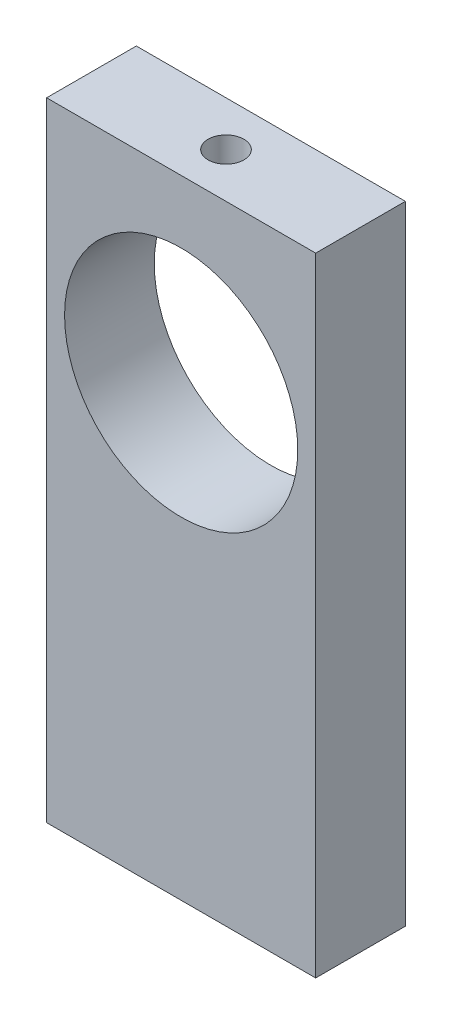
ISO-10303-21;
HEADER;
FILE_DESCRIPTION(('STEP AP214'),'2;1');
FILE_NAME('part.step','',(''),(''),'','','');
FILE_SCHEMA(('AUTOMOTIVE_DESIGN { 1 0 10303 214 1 1 1 1 }'));
ENDSEC;
DATA;
#1=APPLICATION_CONTEXT('core data for automotive mechanical design processes');
#2=APPLICATION_PROTOCOL_DEFINITION('international standard','automotive_design',2000,#1);
#3=PRODUCT_CONTEXT('',#1,'mechanical');
#4=PRODUCT('Part','Part','',(#3));
#5=PRODUCT_RELATED_PRODUCT_CATEGORY('part','',(#4));
#6=PRODUCT_DEFINITION_FORMATION('','',#4);
#7=PRODUCT_DEFINITION_CONTEXT('part definition',#1,'design');
#8=PRODUCT_DEFINITION('design','',#6,#7);
#9=PRODUCT_DEFINITION_SHAPE('','',#8);
#10=(LENGTH_UNIT() NAMED_UNIT(*) SI_UNIT(.MILLI.,.METRE.));
#11=(NAMED_UNIT(*) PLANE_ANGLE_UNIT() SI_UNIT($,.RADIAN.));
#12=(NAMED_UNIT(*) SI_UNIT($,.STERADIAN.) SOLID_ANGLE_UNIT());
#13=UNCERTAINTY_MEASURE_WITH_UNIT(LENGTH_MEASURE(1.E-05),#10,'distance_accuracy_value','');
#14=(GEOMETRIC_REPRESENTATION_CONTEXT(3) GLOBAL_UNCERTAINTY_ASSIGNED_CONTEXT((#13)) GLOBAL_UNIT_ASSIGNED_CONTEXT((#10,
#11,#12)) REPRESENTATION_CONTEXT('',''));
#15=CARTESIAN_POINT('',(0.,0.,0.));
#16=DIRECTION('',(0.,0.,1.));
#17=DIRECTION('',(1.,0.,0.));
#18=AXIS2_PLACEMENT_3D('',#15,#16,#17);
#19=CARTESIAN_POINT('',(11.8977589929443,22.4099438385153,5.));
#20=DIRECTION('',(-1.,0.,0.));
#21=DIRECTION('',(0.,-1.,0.));
#22=AXIS2_PLACEMENT_3D('',#19,#20,#21);
#23=PLANE('',#22);
#24=DIRECTION('',(0.,1.,0.));
#25=VECTOR('',#24,1.);
#26=CARTESIAN_POINT('',(11.8977589929443,22.4099438385153,0.));
#27=LINE('',#26,#25);
#28=CARTESIAN_POINT('',(11.8977589929443,-12.5900561614847,0.));
#29=VERTEX_POINT('',#28);
#30=CARTESIAN_POINT('',(11.8977589929443,22.4099438385153,0.));
#31=VERTEX_POINT('',#30);
#32=EDGE_CURVE('E96',#29,#31,#27,.T.);
#33=ORIENTED_EDGE('',*,*,#32,.T.);
#34=DIRECTION('',(0.,0.,-1.));
#35=VECTOR('',#34,1.);
#36=CARTESIAN_POINT('',(11.8977589929443,22.4099438385153,5.));
#37=LINE('',#36,#35);
#38=CARTESIAN_POINT('',(11.8977589929443,22.4099438385153,5.));
#39=VERTEX_POINT('',#38);
#40=EDGE_CURVE('E11',#39,#31,#37,.T.);
#41=ORIENTED_EDGE('',*,*,#40,.F.);
#42=DIRECTION('',(0.,1.,0.));
#43=VECTOR('',#42,1.);
#44=CARTESIAN_POINT('',(11.8977589929443,22.4099438385153,5.));
#45=LINE('',#44,#43);
#46=CARTESIAN_POINT('',(11.8977589929443,-12.5900561614847,5.));
#47=VERTEX_POINT('',#46);
#48=EDGE_CURVE('E84',#47,#39,#45,.T.);
#49=ORIENTED_EDGE('',*,*,#48,.F.);
#50=DIRECTION('',(0.,0.,-1.));
#51=VECTOR('',#50,1.);
#52=CARTESIAN_POINT('',(11.8977589929443,-12.5900561614847,5.));
#53=LINE('',#52,#51);
#54=EDGE_CURVE('E92',#47,#29,#53,.T.);
#55=ORIENTED_EDGE('',*,*,#54,.T.);
#56=EDGE_LOOP('',(#33,#41,#49,#55));
#57=FACE_BOUND('',#56,.T.);
#58=ADVANCED_FACE('F33',(#57),#23,.F.);
#59=CARTESIAN_POINT('',(-3.10224100705567,22.4099438385153,5.));
#60=DIRECTION('',(0.,-1.,0.));
#61=DIRECTION('',(0.,0.,-1.));
#62=AXIS2_PLACEMENT_3D('',#59,#60,#61);
#63=PLANE('',#62);
#64=CARTESIAN_POINT('',(4.39775899294432,22.4099438385153,2.5));
#65=DIRECTION('',(0.,1.,0.));
#66=DIRECTION('',(0.,0.,1.));
#67=AXIS2_PLACEMENT_3D('',#64,#65,#66);
#68=CIRCLE('',#67,1.);
#69=CARTESIAN_POINT('',(4.39775899294432,22.4099438385153,3.5));
#70=VERTEX_POINT('',#69);
#71=EDGE_CURVE('E115',#70,#70,#68,.T.);
#72=ORIENTED_EDGE('',*,*,#71,.F.);
#73=EDGE_LOOP('',(#72));
#74=FACE_BOUND('',#73,.T.);
#75=DIRECTION('',(-1.,0.,0.));
#76=VECTOR('',#75,1.);
#77=CARTESIAN_POINT('',(-3.10224100705567,22.4099438385153,0.));
#78=LINE('',#77,#76);
#79=CARTESIAN_POINT('',(-3.10224100705567,22.4099438385153,0.));
#80=VERTEX_POINT('',#79);
#81=EDGE_CURVE('E88',#31,#80,#78,.T.);
#82=ORIENTED_EDGE('',*,*,#81,.T.);
#83=DIRECTION('',(0.,0.,-1.));
#84=VECTOR('',#83,1.);
#85=CARTESIAN_POINT('',(-3.10224100705567,22.4099438385153,5.));
#86=LINE('',#85,#84);
#87=CARTESIAN_POINT('',(-3.10224100705567,22.4099438385153,5.));
#88=VERTEX_POINT('',#87);
#89=EDGE_CURVE('E41',#88,#80,#86,.T.);
#90=ORIENTED_EDGE('',*,*,#89,.F.);
#91=DIRECTION('',(-1.,0.,0.));
#92=VECTOR('',#91,1.);
#93=CARTESIAN_POINT('',(-3.10224100705567,22.4099438385153,5.));
#94=LINE('',#93,#92);
#95=EDGE_CURVE('E79',#39,#88,#94,.T.);
#96=ORIENTED_EDGE('',*,*,#95,.F.);
#97=ORIENTED_EDGE('',*,*,#40,.T.);
#98=EDGE_LOOP('',(#82,#90,#96,#97));
#99=FACE_BOUND('',#98,.T.);
#100=ADVANCED_FACE('F87',(#74,#99),#63,.F.);
#101=CARTESIAN_POINT('',(-3.10224100705567,22.4099438385153,5.));
#102=DIRECTION('',(1.,0.,0.));
#103=DIRECTION('',(0.,1.,0.));
#104=AXIS2_PLACEMENT_3D('',#101,#102,#103);
#105=PLANE('',#104);
#106=DIRECTION('',(0.,-1.,0.));
#107=VECTOR('',#106,1.);
#108=CARTESIAN_POINT('',(-3.10224100705567,22.4099438385153,0.));
#109=LINE('',#108,#107);
#110=CARTESIAN_POINT('',(-3.10224100705568,-12.5900561614847,0.));
#111=VERTEX_POINT('',#110);
#112=EDGE_CURVE('E66',#80,#111,#109,.T.);
#113=ORIENTED_EDGE('',*,*,#112,.T.);
#114=DIRECTION('',(0.,0.,-1.));
#115=VECTOR('',#114,1.);
#116=CARTESIAN_POINT('',(-3.10224100705568,-12.5900561614847,5.));
#117=LINE('',#116,#115);
#118=CARTESIAN_POINT('',(-3.10224100705568,-12.5900561614847,5.));
#119=VERTEX_POINT('',#118);
#120=EDGE_CURVE('E89',#119,#111,#117,.T.);
#121=ORIENTED_EDGE('',*,*,#120,.F.);
#122=DIRECTION('',(0.,-1.,0.));
#123=VECTOR('',#122,1.);
#124=CARTESIAN_POINT('',(-3.10224100705567,22.4099438385153,5.));
#125=LINE('',#124,#123);
#126=EDGE_CURVE('E82',#88,#119,#125,.T.);
#127=ORIENTED_EDGE('',*,*,#126,.F.);
#128=ORIENTED_EDGE('',*,*,#89,.T.);
#129=EDGE_LOOP('',(#113,#121,#127,#128));
#130=FACE_BOUND('',#129,.T.);
#131=ADVANCED_FACE('F90',(#130),#105,.F.);
#132=CARTESIAN_POINT('',(-3.10224100705568,-12.5900561614847,5.));
#133=DIRECTION('',(0.,1.,0.));
#134=DIRECTION('',(0.,0.,1.));
#135=AXIS2_PLACEMENT_3D('',#132,#133,#134);
#136=PLANE('',#135);
#137=DIRECTION('',(1.,0.,0.));
#138=VECTOR('',#137,1.);
#139=CARTESIAN_POINT('',(-3.10224100705568,-12.5900561614847,0.));
#140=LINE('',#139,#138);
#141=EDGE_CURVE('E72',#111,#29,#140,.T.);
#142=ORIENTED_EDGE('',*,*,#141,.T.);
#143=ORIENTED_EDGE('',*,*,#54,.F.);
#144=DIRECTION('',(1.,0.,0.));
#145=VECTOR('',#144,1.);
#146=CARTESIAN_POINT('',(-3.10224100705568,-12.5900561614847,5.));
#147=LINE('',#146,#145);
#148=EDGE_CURVE('E49',#119,#47,#147,.T.);
#149=ORIENTED_EDGE('',*,*,#148,.F.);
#150=ORIENTED_EDGE('',*,*,#120,.T.);
#151=EDGE_LOOP('',(#142,#143,#149,#150));
#152=FACE_BOUND('',#151,.T.);
#153=ADVANCED_FACE('F104',(#152),#136,.F.);
#154=CARTESIAN_POINT('',(0.,0.,5.));
#155=DIRECTION('',(0.,0.,1.));
#156=DIRECTION('',(1.,0.,0.));
#157=AXIS2_PLACEMENT_3D('',#154,#155,#156);
#158=PLANE('',#157);
#159=CARTESIAN_POINT('',(4.39775899294432,12.4099438385153,5.));
#160=DIRECTION('',(0.,0.,1.));
#161=DIRECTION('',(1.,0.,0.));
#162=AXIS2_PLACEMENT_3D('',#159,#160,#161);
#163=CIRCLE('',#162,6.5);
#164=CARTESIAN_POINT('',(10.8977589929443,12.4099438385153,5.));
#165=VERTEX_POINT('',#164);
#166=EDGE_CURVE('E99',#165,#165,#163,.F.);
#167=ORIENTED_EDGE('',*,*,#166,.T.);
#168=EDGE_LOOP('',(#167));
#169=FACE_BOUND('',#168,.T.);
#170=ORIENTED_EDGE('',*,*,#48,.T.);
#171=ORIENTED_EDGE('',*,*,#95,.T.);
#172=ORIENTED_EDGE('',*,*,#126,.T.);
#173=ORIENTED_EDGE('',*,*,#148,.T.);
#174=EDGE_LOOP('',(#170,#171,#172,#173));
#175=FACE_BOUND('',#174,.T.);
#176=ADVANCED_FACE('F80',(#169,#175),#158,.T.);
#177=CARTESIAN_POINT('',(0.,0.,0.));
#178=DIRECTION('',(0.,0.,1.));
#179=DIRECTION('',(1.,0.,0.));
#180=AXIS2_PLACEMENT_3D('',#177,#178,#179);
#181=PLANE('',#180);
#182=CARTESIAN_POINT('',(4.39775899294432,12.4099438385153,0.));
#183=DIRECTION('',(0.,0.,-1.));
#184=DIRECTION('',(-1.,0.,0.));
#185=AXIS2_PLACEMENT_3D('',#182,#183,#184);
#186=CIRCLE('',#185,6.5);
#187=CARTESIAN_POINT('',(-2.10224100705568,12.4099438385153,0.));
#188=VERTEX_POINT('',#187);
#189=EDGE_CURVE('E112',#188,#188,#186,.T.);
#190=ORIENTED_EDGE('',*,*,#189,.F.);
#191=EDGE_LOOP('',(#190));
#192=FACE_BOUND('',#191,.T.);
#193=ORIENTED_EDGE('',*,*,#32,.F.);
#194=ORIENTED_EDGE('',*,*,#141,.F.);
#195=ORIENTED_EDGE('',*,*,#112,.F.);
#196=ORIENTED_EDGE('',*,*,#81,.F.);
#197=EDGE_LOOP('',(#193,#194,#195,#196));
#198=FACE_BOUND('',#197,.T.);
#199=ADVANCED_FACE('F107',(#192,#198),#181,.F.);
#200=CARTESIAN_POINT('',(4.39775899294432,12.4099438385153,23.3847763108502));
#201=DIRECTION('',(0.,0.,-1.));
#202=DIRECTION('',(-1.,0.,0.));
#203=AXIS2_PLACEMENT_3D('',#200,#201,#202);
#204=CYLINDRICAL_SURFACE('',#203,6.5);
#205=CARTESIAN_POINT('',(4.39775899294432,18.9099438385153,3.5));
#206=CARTESIAN_POINT('',(4.34194192821443,18.909942928437,3.49999771150166));
#207=CARTESIAN_POINT('',(4.28609290147976,18.9092173419481,3.49531090368352));
#208=CARTESIAN_POINT('',(4.17595709312032,18.9063926741546,3.47669292681173));
#209=CARTESIAN_POINT('',(4.12167186633097,18.9042922719973,3.46275286752388));
#210=CARTESIAN_POINT('',(4.01627338206081,18.8989539110332,3.42605577766578));
#211=CARTESIAN_POINT('',(3.96515771822974,18.8957168279571,3.40330553332364));
#212=CARTESIAN_POINT('',(3.86747690767328,18.8884624083617,3.34965072252428));
#213=CARTESIAN_POINT('',(3.82091115497243,18.8844451759593,3.31874724398168));
#214=CARTESIAN_POINT('',(3.73326260693195,18.8760400400751,3.249393273145));
#215=CARTESIAN_POINT('',(3.69222253221327,18.8716496339688,3.21088908872618));
#216=CARTESIAN_POINT('',(3.61715900175683,18.8630124680843,3.12754224918582));
#217=CARTESIAN_POINT('',(3.58313595803217,18.8587657167531,3.0826992221322));
#218=CARTESIAN_POINT('',(3.52290487177407,18.8508724233246,2.98765913860707));
#219=CARTESIAN_POINT('',(3.49673836779408,18.8472291156143,2.93743546536745));
#220=CARTESIAN_POINT('',(3.45322862631524,18.8409895153816,2.83324056046732));
#221=CARTESIAN_POINT('',(3.43588488264646,18.8383931627962,2.7792695439973));
#222=CARTESIAN_POINT('',(3.41064609728251,18.8345661173302,2.66956210452274));
#223=CARTESIAN_POINT('',(3.40267777556544,18.833324838535,2.61384291605742));
#224=CARTESIAN_POINT('',(3.3961889682869,18.832316371306,2.50184553504764));
#225=CARTESIAN_POINT('',(3.39766791243189,18.8325490938926,2.44556737645073));
#226=CARTESIAN_POINT('',(3.4099718131325,18.8344526578466,2.33456844816827));
#227=CARTESIAN_POINT('',(3.42071499850267,18.8361109162698,2.27983836744507));
#228=CARTESIAN_POINT('',(3.45111434597191,18.8406590428657,2.17296695886779));
#229=CARTESIAN_POINT('',(3.4707707721673,18.8435489475314,2.12082570777066));
#230=CARTESIAN_POINT('',(3.51852319786029,18.8502485781034,2.02036415114948));
#231=CARTESIAN_POINT('',(3.54665368213942,18.8540620497492,1.97206049732752));
#232=CARTESIAN_POINT('',(3.61053116057021,18.8621764488772,1.88082812533227));
#233=CARTESIAN_POINT('',(3.64627868015322,18.8664774099775,1.83789977827796));
#234=CARTESIAN_POINT('',(3.72482360588957,18.8751377060759,1.75816281137867));
#235=CARTESIAN_POINT('',(3.76769128431997,18.8794971788533,1.72142339296305));
#236=CARTESIAN_POINT('',(3.85902057507871,18.8877412789288,1.65564954808448));
#237=CARTESIAN_POINT('',(3.90748221425907,18.8916259039473,1.62661515860927));
#238=CARTESIAN_POINT('',(4.00868488833338,18.8984869839693,1.57707138740458));
#239=CARTESIAN_POINT('',(4.06142866331264,18.9014628515792,1.55656751645787));
#240=CARTESIAN_POINT('',(4.16966695209894,18.9061662529883,1.52472787162819));
#241=CARTESIAN_POINT('',(4.22516126988794,18.9078938756077,1.51339144541937));
#242=CARTESIAN_POINT('',(4.33672828611617,18.9098943273198,1.50030090591039));
#243=CARTESIAN_POINT('',(4.39278957587016,18.9101815949583,1.49845168566703));
#244=CARTESIAN_POINT('',(4.50442152229069,18.9093083264077,1.50413535980211));
#245=CARTESIAN_POINT('',(4.55999219489968,18.9081478374386,1.51166794818305));
#246=CARTESIAN_POINT('',(4.66877611719258,18.9045183804082,1.53582232530444));
#247=CARTESIAN_POINT('',(4.7219999348088,18.9020561087476,1.55239761198312));
#248=CARTESIAN_POINT('',(4.82491313691416,18.8960982254999,1.59411771718107));
#249=CARTESIAN_POINT('',(4.87460234787255,18.892602563222,1.61926295608978));
#250=CARTESIAN_POINT('',(4.96945292252004,18.8849303373486,1.67763113339323));
#251=CARTESIAN_POINT('',(5.01457687544075,18.8807487854803,1.71091419787756));
#252=CARTESIAN_POINT('',(5.09863269053694,18.8721852806067,1.78452975470954));
#253=CARTESIAN_POINT('',(5.13756417281646,18.8678033153275,1.82486267923396));
#254=CARTESIAN_POINT('',(5.20847742882963,18.8592868732839,1.91185716547467));
#255=CARTESIAN_POINT('',(5.24039533421497,18.8551549008395,1.95857107202704));
#256=CARTESIAN_POINT('',(5.29593099482059,18.8476511689917,2.05675318822579));
#257=CARTESIAN_POINT('',(5.31954898333486,18.8442793882218,2.10822126419066));
#258=CARTESIAN_POINT('',(5.35771615904862,18.8386960839255,2.21426291749236));
#259=CARTESIAN_POINT('',(5.37229855185675,18.8364803168781,2.26882430992077));
#260=CARTESIAN_POINT('',(5.39208602916787,18.833448774013,2.3796585061016));
#261=CARTESIAN_POINT('',(5.39729179796081,18.8326328960341,2.43593118466248));
#262=CARTESIAN_POINT('',(5.3981613502295,18.8324974550094,2.54795373512273));
#263=CARTESIAN_POINT('',(5.39392557840667,18.8331621407974,2.60370283416755));
#264=CARTESIAN_POINT('',(5.37624796698259,18.8358786377936,2.71368560502705));
#265=CARTESIAN_POINT('',(5.3628061452591,18.837930446308,2.76791927978441));
#266=CARTESIAN_POINT('',(5.32713418398742,18.8431843879374,2.87330142061881));
#267=CARTESIAN_POINT('',(5.30491142812327,18.8463855543781,2.92445243728954));
#268=CARTESIAN_POINT('',(5.25231847882722,18.853578640717,3.02231633449056));
#269=CARTESIAN_POINT('',(5.22194798073423,18.8575705901829,3.06902904897501));
#270=CARTESIAN_POINT('',(5.15355814314609,18.8659459383452,3.15720004857204));
#271=CARTESIAN_POINT('',(5.11546451589811,18.870332889315,3.19860038198435));
#272=CARTESIAN_POINT('',(5.0328667509375,18.8789745823252,3.27445638098134));
#273=CARTESIAN_POINT('',(4.98836112799704,18.8832292934562,3.30891043313144));
#274=CARTESIAN_POINT('',(4.89389785409273,18.8911554429052,3.37007560705592));
#275=CARTESIAN_POINT('',(4.84391004271237,18.8948233505204,3.39674060169619));
#276=CARTESIAN_POINT('',(4.74013155635376,18.9011280800069,3.44125573171417));
#277=CARTESIAN_POINT('',(4.68634485189769,18.903765960147,3.45911491932049));
#278=CARTESIAN_POINT('',(4.59322969297886,18.9071171249214,3.4814985687347));
#279=CARTESIAN_POINT('',(4.55447358060758,18.9081716496161,3.48842589073001));
#280=CARTESIAN_POINT('',(4.4764032611415,18.9095853223806,3.49767738175345));
#281=CARTESIAN_POINT('',(4.43708906154056,18.9099444797788,3.50000161253189));
#282=CARTESIAN_POINT('',(4.39775899294432,18.9099438385153,3.5));
#283=B_SPLINE_CURVE_WITH_KNOTS('',3,(#205,#206,#207,#208,#209,#210,#211,#212,#213,#214,#215,
#216,#217,#218,#219,#220,#221,#222,#223,#224,#225,#226,#227,#228,#229,#230,#231,#232,#233,#234,
#235,#236,#237,#238,#239,#240,#241,#242,#243,#244,#245,#246,#247,#248,#249,#250,#251,#252,#253,
#254,#255,#256,#257,#258,#259,#260,#261,#262,#263,#264,#265,#266,#267,#268,#269,#270,#271,#272,
#273,#274,#275,#276,#277,#278,#279,#280,#281,#282),.UNSPECIFIED.,.T.,.F.,(4,2,2,2,2,2,2,2,2,2,2,
2,2,2,2,2,2,2,2,2,2,2,2,2,2,2,2,2,2,2,2,2,2,2,2,2,2,2,4),(0.,0.167307467701377,
0.334775912289476,0.502115616587677,0.669433003445577,0.837977603302101,1.00653209663435,
1.17596267229177,1.34538352646323,1.51347116858973,1.68154866403561,1.84815762731508,
2.01477152748461,2.18207283092672,2.34938567873227,2.51846034912151,2.68753583113344,
2.85672036828736,3.02589286575468,3.19336608917139,3.36083385041674,3.52744841736623,
3.69407115858382,3.86196430272231,4.02986774280723,4.1992420476724,4.36861159138526,
4.53735495577967,4.70608600507342,4.8730305701356,5.03997481099962,5.20677897004385,
5.37358936711325,5.54208769222918,5.71062511000444,5.88014126810577,6.04948280110168,
6.16737331520001,6.28526224779081),.UNSPECIFIED.);
#284=CARTESIAN_POINT('',(4.39775899294432,18.9099438385153,3.5));
#285=VERTEX_POINT('',#284);
#286=EDGE_CURVE('E118',#285,#285,#283,.T.);
#287=ORIENTED_EDGE('',*,*,#286,.F.);
#288=EDGE_LOOP('',(#287));
#289=FACE_BOUND('',#288,.T.);
#290=ORIENTED_EDGE('',*,*,#189,.T.);
#291=EDGE_LOOP('',(#290));
#292=FACE_BOUND('',#291,.T.);
#293=ORIENTED_EDGE('',*,*,#166,.F.);
#294=EDGE_LOOP('',(#293));
#295=FACE_BOUND('',#294,.T.);
#296=ADVANCED_FACE('F129',(#289,#292,#295),#204,.F.);
#297=CARTESIAN_POINT('',(4.39775899294432,-12.5910561614847,2.5));
#298=DIRECTION('',(0.,1.,0.));
#299=DIRECTION('',(0.,0.,1.));
#300=AXIS2_PLACEMENT_3D('',#297,#298,#299);
#301=CYLINDRICAL_SURFACE('',#300,1.);
#302=ORIENTED_EDGE('',*,*,#71,.T.);
#303=EDGE_LOOP('',(#302));
#304=FACE_BOUND('',#303,.T.);
#305=ORIENTED_EDGE('',*,*,#286,.T.);
#306=EDGE_LOOP('',(#305));
#307=FACE_BOUND('',#306,.T.);
#308=ADVANCED_FACE('F124',(#304,#307),#301,.F.);
#309=CLOSED_SHELL('',(#58,#100,#131,#153,#176,#199,#296,#308));
#310=MANIFOLD_SOLID_BREP('B2',#309);
#311=ADVANCED_BREP_SHAPE_REPRESENTATION('',(#18,#310),#14);
#312=SHAPE_DEFINITION_REPRESENTATION(#9,#311);
ENDSEC;
END-ISO-10303-21;
